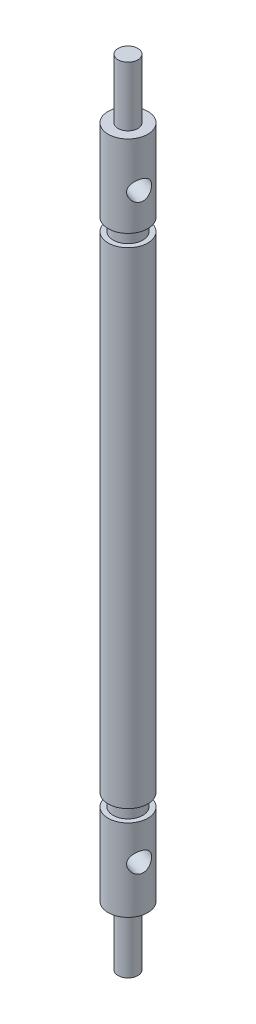
ISO-10303-21;
HEADER;
FILE_DESCRIPTION(('STEP AP214'),'2;1');
FILE_NAME('part.step','',(''),(''),'','','');
FILE_SCHEMA(('AUTOMOTIVE_DESIGN { 1 0 10303 214 1 1 1 1 }'));
ENDSEC;
DATA;
#1=APPLICATION_CONTEXT('core data for automotive mechanical design processes');
#2=APPLICATION_PROTOCOL_DEFINITION('international standard','automotive_design',2000,#1);
#3=PRODUCT_CONTEXT('',#1,'mechanical');
#4=PRODUCT('Part','Part','',(#3));
#5=PRODUCT_RELATED_PRODUCT_CATEGORY('part','',(#4));
#6=PRODUCT_DEFINITION_FORMATION('','',#4);
#7=PRODUCT_DEFINITION_CONTEXT('part definition',#1,'design');
#8=PRODUCT_DEFINITION('design','',#6,#7);
#9=PRODUCT_DEFINITION_SHAPE('','',#8);
#10=(LENGTH_UNIT() NAMED_UNIT(*) SI_UNIT(.MILLI.,.METRE.));
#11=(NAMED_UNIT(*) PLANE_ANGLE_UNIT() SI_UNIT($,.RADIAN.));
#12=(NAMED_UNIT(*) SI_UNIT($,.STERADIAN.) SOLID_ANGLE_UNIT());
#13=UNCERTAINTY_MEASURE_WITH_UNIT(LENGTH_MEASURE(1.E-05),#10,'distance_accuracy_value','');
#14=(GEOMETRIC_REPRESENTATION_CONTEXT(3) GLOBAL_UNCERTAINTY_ASSIGNED_CONTEXT((#13)) GLOBAL_UNIT_ASSIGNED_CONTEXT((#10,
#11,#12)) REPRESENTATION_CONTEXT('',''));
#15=CARTESIAN_POINT('',(0.,0.,0.));
#16=DIRECTION('',(0.,0.,1.));
#17=DIRECTION('',(1.,0.,0.));
#18=AXIS2_PLACEMENT_3D('',#15,#16,#17);
#19=CARTESIAN_POINT('',(0.,20.,1.));
#20=DIRECTION('',(0.,1.,0.));
#21=DIRECTION('',(0.,0.,1.));
#22=AXIS2_PLACEMENT_3D('',#19,#20,#21);
#23=CYLINDRICAL_SURFACE('',#22,2.);
#24=CARTESIAN_POINT('',(0.,4.5,1.));
#25=DIRECTION('',(0.,1.,0.));
#26=DIRECTION('',(0.,0.,1.));
#27=AXIS2_PLACEMENT_3D('',#24,#25,#26);
#28=CIRCLE('',#27,2.);
#29=CARTESIAN_POINT('',(0.,4.5,3.));
#30=VERTEX_POINT('',#29);
#31=EDGE_CURVE('E47',#30,#30,#28,.T.);
#32=ORIENTED_EDGE('',*,*,#31,.F.);
#33=EDGE_LOOP('',(#32));
#34=FACE_BOUND('',#33,.T.);
#35=CARTESIAN_POINT('',(0.,-44.5,0.999999999999996));
#36=DIRECTION('',(0.,1.,0.));
#37=DIRECTION('',(0.,0.,1.));
#38=AXIS2_PLACEMENT_3D('',#35,#36,#37);
#39=CIRCLE('',#38,2.);
#40=CARTESIAN_POINT('',(0.,-44.5,3.));
#41=VERTEX_POINT('',#40);
#42=EDGE_CURVE('E97',#41,#41,#39,.T.);
#43=ORIENTED_EDGE('',*,*,#42,.T.);
#44=EDGE_LOOP('',(#43));
#45=FACE_BOUND('',#44,.T.);
#46=ADVANCED_FACE('F32',(#34,#45),#23,.T.);
#47=CARTESIAN_POINT('',(0.,4.5,-0.499999999999998));
#48=DIRECTION('',(0.,-1.,0.));
#49=DIRECTION('',(0.,0.,-1.));
#50=AXIS2_PLACEMENT_3D('',#47,#48,#49);
#51=PLANE('',#50);
#52=CARTESIAN_POINT('',(0.,4.5,1.));
#53=DIRECTION('',(0.,1.,0.));
#54=DIRECTION('',(0.,0.,1.));
#55=AXIS2_PLACEMENT_3D('',#52,#53,#54);
#56=CIRCLE('',#55,1.5);
#57=CARTESIAN_POINT('',(0.,4.5,2.5));
#58=VERTEX_POINT('',#57);
#59=EDGE_CURVE('E122',#58,#58,#56,.T.);
#60=ORIENTED_EDGE('',*,*,#59,.F.);
#61=EDGE_LOOP('',(#60));
#62=FACE_BOUND('',#61,.T.);
#63=ORIENTED_EDGE('',*,*,#31,.T.);
#64=EDGE_LOOP('',(#63));
#65=FACE_BOUND('',#64,.T.);
#66=ADVANCED_FACE('F85',(#62,#65),#51,.F.);
#67=CARTESIAN_POINT('',(0.,20.,1.));
#68=DIRECTION('',(0.,1.,0.));
#69=DIRECTION('',(0.,0.,1.));
#70=AXIS2_PLACEMENT_3D('',#67,#68,#69);
#71=CYLINDRICAL_SURFACE('',#70,1.5);
#72=CARTESIAN_POINT('',(0.,5.75,1.));
#73=DIRECTION('',(0.,1.,0.));
#74=DIRECTION('',(0.,0.,1.));
#75=AXIS2_PLACEMENT_3D('',#72,#73,#74);
#76=CIRCLE('',#75,1.5);
#77=CARTESIAN_POINT('',(0.,5.75,2.5));
#78=VERTEX_POINT('',#77);
#79=EDGE_CURVE('E119',#78,#78,#76,.T.);
#80=ORIENTED_EDGE('',*,*,#79,.F.);
#81=EDGE_LOOP('',(#80));
#82=FACE_BOUND('',#81,.T.);
#83=ORIENTED_EDGE('',*,*,#59,.T.);
#84=EDGE_LOOP('',(#83));
#85=FACE_BOUND('',#84,.T.);
#86=ADVANCED_FACE('F90',(#82,#85),#71,.T.);
#87=CARTESIAN_POINT('',(0.,5.75,-0.999999999999998));
#88=DIRECTION('',(0.,1.,0.));
#89=DIRECTION('',(0.,0.,1.));
#90=AXIS2_PLACEMENT_3D('',#87,#88,#89);
#91=PLANE('',#90);
#92=CARTESIAN_POINT('',(0.,5.75,1.));
#93=DIRECTION('',(0.,1.,0.));
#94=DIRECTION('',(0.,0.,1.));
#95=AXIS2_PLACEMENT_3D('',#92,#93,#94);
#96=CIRCLE('',#95,2.);
#97=CARTESIAN_POINT('',(0.,5.75,3.));
#98=VERTEX_POINT('',#97);
#99=EDGE_CURVE('E116',#98,#98,#96,.T.);
#100=ORIENTED_EDGE('',*,*,#99,.F.);
#101=EDGE_LOOP('',(#100));
#102=FACE_BOUND('',#101,.T.);
#103=ORIENTED_EDGE('',*,*,#79,.T.);
#104=EDGE_LOOP('',(#103));
#105=FACE_BOUND('',#104,.T.);
#106=ADVANCED_FACE('F153',(#102,#105),#91,.F.);
#107=CARTESIAN_POINT('',(0.,20.,1.));
#108=DIRECTION('',(0.,1.,0.));
#109=DIRECTION('',(0.,0.,1.));
#110=AXIS2_PLACEMENT_3D('',#107,#108,#109);
#111=CYLINDRICAL_SURFACE('',#110,2.);
#112=CARTESIAN_POINT('',(-1.34066947021641,9.34,-0.48411770814503));
#113=CARTESIAN_POINT('',(-1.34067495631126,9.39221773851281,-0.484115624522332));
#114=CARTESIAN_POINT('',(-1.34421081386421,9.44450094997925,-0.480942178894521));
#115=CARTESIAN_POINT('',(-1.3579592981871,9.54746101118554,-0.46834191425801));
#116=CARTESIAN_POINT('',(-1.3681858840927,9.59813426973562,-0.458902020702856));
#117=CARTESIAN_POINT('',(-1.39416948498015,9.69619051353914,-0.434088276347091));
#118=CARTESIAN_POINT('',(-1.40989695468266,9.74358948782048,-0.418746083694171));
#119=CARTESIAN_POINT('',(-1.44554738956168,9.83444453417774,-0.382403252787771));
#120=CARTESIAN_POINT('',(-1.46547059968958,9.8779003758377,-0.361402284149436));
#121=CARTESIAN_POINT('',(-1.50992656043854,9.96361420000878,-0.311988525365269));
#122=CARTESIAN_POINT('',(-1.53470453969664,10.0054741165359,-0.283105567725859));
#123=CARTESIAN_POINT('',(-1.58596273087061,10.0830260022796,-0.219180544457392));
#124=CARTESIAN_POINT('',(-1.61244378645763,10.1187148816874,-0.184135411065621));
#125=CARTESIAN_POINT('',(-1.66736489283058,10.1852813744549,-0.105594797027601));
#126=CARTESIAN_POINT('',(-1.69581598813462,10.2156684548915,-0.0616873751250207));
#127=CARTESIAN_POINT('',(-1.75105325750186,10.2673324658992,0.032132642247083));
#128=CARTESIAN_POINT('',(-1.77784047819767,10.2886151740627,0.0820414034529253));
#129=CARTESIAN_POINT('',(-1.82626343286979,10.3198868706825,0.182893143403869));
#130=CARTESIAN_POINT('',(-1.84813049038064,10.330574153209,0.233507429846059));
#131=CARTESIAN_POINT('',(-1.88784758122288,10.3426520720294,0.337343222890974));
#132=CARTESIAN_POINT('',(-1.90570005270006,10.344048365757,0.390563122999552));
#133=CARTESIAN_POINT('',(-1.93536069636102,10.3377723519725,0.493070055571755));
#134=CARTESIAN_POINT('',(-1.94756072734062,10.3308818468427,0.542294364146645));
#135=CARTESIAN_POINT('',(-1.96795526725166,10.309628005977,0.639943753413213));
#136=CARTESIAN_POINT('',(-1.97614947623568,10.2952641108157,0.688368773993674));
#137=CARTESIAN_POINT('',(-1.98886541828187,10.2593801839495,0.78375113595944));
#138=CARTESIAN_POINT('',(-1.99333498667439,10.2377642648103,0.830679055962354));
#139=CARTESIAN_POINT('',(-1.99896329089706,10.1881235594648,0.921219220578743));
#140=CARTESIAN_POINT('',(-2.0001208413929,10.160096482651,0.964830272688036));
#141=CARTESIAN_POINT('',(-1.99984689182395,10.0953749694863,1.05170908966417));
#142=CARTESIAN_POINT('',(-1.99815933426021,10.0581104942877,1.09455172463637));
#143=CARTESIAN_POINT('',(-1.99281688182107,9.97749650069065,1.17397918749707));
#144=CARTESIAN_POINT('',(-1.98916046838964,9.93414230446298,1.21055915632273));
#145=CARTESIAN_POINT('',(-1.98084631998412,9.8391811107234,1.27836898082197));
#146=CARTESIAN_POINT('',(-1.9761394451166,9.78722335066909,1.30910599564311));
#147=CARTESIAN_POINT('',(-1.96740815472639,9.67850833963811,1.36054489321221));
#148=CARTESIAN_POINT('',(-1.963383027159,9.62175619016679,1.38125728862269));
#149=CARTESIAN_POINT('',(-1.957572056952,9.50979941671064,1.41001521288068));
#150=CARTESIAN_POINT('',(-1.95563384023932,9.45482947527613,1.41893562362223));
#151=CARTESIAN_POINT('',(-1.95403152642566,9.34417238365376,1.42635528222071));
#152=CARTESIAN_POINT('',(-1.95436580426025,9.28848577439312,1.4248619769227));
#153=CARTESIAN_POINT('',(-1.9570404244063,9.18452110507452,1.41233783149607));
#154=CARTESIAN_POINT('',(-1.9591556222701,9.13610292227565,1.40237624149801));
#155=CARTESIAN_POINT('',(-1.96459428602879,9.04152969014304,1.37491820590618));
#156=CARTESIAN_POINT('',(-1.96791814566067,8.99537538386275,1.35741930459393));
#157=CARTESIAN_POINT('',(-1.97520296616847,8.90420808546271,1.31473886781424));
#158=CARTESIAN_POINT('',(-1.97918629491854,8.85934680127512,1.2892392230706));
#159=CARTESIAN_POINT('',(-1.98672573361009,8.77387019246418,1.23185748735409));
#160=CARTESIAN_POINT('',(-1.99028162248134,8.73325706636919,1.19997211624253));
#161=CARTESIAN_POINT('',(-1.99639013921947,8.65204111486908,1.12632084651964));
#162=CARTESIAN_POINT('',(-1.99875835572752,8.61209272080098,1.08381473372484));
#163=CARTESIAN_POINT('',(-2.0005027414476,8.53922501037293,0.99306619968765));
#164=CARTESIAN_POINT('',(-1.99987788555245,8.50630810628365,0.944821818644455));
#165=CARTESIAN_POINT('',(-1.99446779347877,8.44768726585805,0.842565307943967));
#166=CARTESIAN_POINT('',(-1.98957111330545,8.42220113798984,0.788432949866542));
#167=CARTESIAN_POINT('',(-1.97459030366968,8.38076693635274,0.677315911463264));
#168=CARTESIAN_POINT('',(-1.96451076626041,8.36481044625375,0.62033379632291));
#169=CARTESIAN_POINT('',(-1.94001702376064,8.34427022614501,0.510936465631762));
#170=CARTESIAN_POINT('',(-1.92608718972947,8.3387748920953,0.458583648683799));
#171=CARTESIAN_POINT('',(-1.89392673999677,8.33662166463897,0.355038005447414));
#172=CARTESIAN_POINT('',(-1.87569764744383,8.33996064566738,0.30384477536266));
#173=CARTESIAN_POINT('',(-1.83699936104178,8.35477926771913,0.207567698071333));
#174=CARTESIAN_POINT('',(-1.81675944544781,8.36570334513352,0.1623039210795));
#175=CARTESIAN_POINT('',(-1.77402976360227,8.39463039906374,0.0752452691903192));
#176=CARTESIAN_POINT('',(-1.75153967658405,8.41263438591048,0.0334508904211201));
#177=CARTESIAN_POINT('',(-1.70433486705677,8.45600753267434,-0.047634371898612));
#178=CARTESIAN_POINT('',(-1.67956618093429,8.48165793232672,-0.0867425972166629));
#179=CARTESIAN_POINT('',(-1.62989128939637,8.53924318805283,-0.159919650540692));
#180=CARTESIAN_POINT('',(-1.60498502598975,8.5711809280959,-0.193986153326467));
#181=CARTESIAN_POINT('',(-1.5538539302025,8.64413421542679,-0.259939702666818));
#182=CARTESIAN_POINT('',(-1.52774614077153,8.68573804637151,-0.291268538304633));
#183=CARTESIAN_POINT('',(-1.47862187227371,8.77492089879797,-0.347244561152379));
#184=CARTESIAN_POINT('',(-1.45560815968592,8.82250519496273,-0.371885788618689));
#185=CARTESIAN_POINT('',(-1.41390588711489,8.92433664059565,-0.414848892931159));
#186=CARTESIAN_POINT('',(-1.39538143571509,8.97874960036478,-0.432940407552716));
#187=CARTESIAN_POINT('',(-1.36578521112681,9.09142983798596,-0.461184446434746));
#188=CARTESIAN_POINT('',(-1.35468853520988,9.14968351021565,-0.471363517051085));
#189=CARTESIAN_POINT('',(-1.34559685411486,9.2304811406542,-0.479654053608146));
#190=CARTESIAN_POINT('',(-1.34375435515175,9.25230600043196,-0.481326062776323));
#191=CARTESIAN_POINT('',(-1.3412894684682,9.29608337321229,-0.483558365558973));
#192=CARTESIAN_POINT('',(-1.34066716262576,9.31803589468215,-0.484118584569588));
#193=CARTESIAN_POINT('',(-1.34066947021641,9.34,-0.48411770814503));
#194=B_SPLINE_CURVE_WITH_KNOTS('',3,(#112,#113,#114,#115,#116,#117,#118,#119,#120,#121,#122,
#123,#124,#125,#126,#127,#128,#129,#130,#131,#132,#133,#134,#135,#136,#137,#138,#139,#140,#141,
#142,#143,#144,#145,#146,#147,#148,#149,#150,#151,#152,#153,#154,#155,#156,#157,#158,#159,#160,
#161,#162,#163,#164,#165,#166,#167,#168,#169,#170,#171,#172,#173,#174,#175,#176,#177,#178,#179,
#180,#181,#182,#183,#184,#185,#186,#187,#188,#189,#190,#191,#192,#193),.UNSPECIFIED.,.T.,.F.,(4,
2,2,2,2,2,2,2,2,2,2,2,2,2,2,2,2,2,2,2,2,2,2,2,2,2,2,2,2,2,2,2,2,2,2,2,2,2,2,2,4),(0.,
0.156560781054806,0.313449247279704,0.469507686493071,0.625575239076685,0.794582966529236,
0.963675071838096,1.1442364049838,1.32468298415071,1.49223647585247,1.65968793217422,
1.81250654896193,1.96533660672969,2.12027273977692,2.27526431580864,2.44496082287924,
2.61478840279813,2.79549513724577,2.97601195451833,3.14220129757097,3.30827181086935,
3.45604002336207,3.60385641642282,3.75851464903216,3.91325252922087,4.08761323803976,
4.26203366849885,4.44114524425388,4.6200983984601,4.78258010188716,4.94500432726418,
5.09663786318893,5.24829304567236,5.40641280363968,5.56460526000016,5.73860992904884,
5.91276915907046,6.09256560100657,6.27175618823166,6.33760520541497,6.40345864108013),.UNSPECIFIED.);
#195=CARTESIAN_POINT('',(-1.34066947021641,9.34,-0.48411770814503));
#196=VERTEX_POINT('',#195);
#197=EDGE_CURVE('E52',#196,#196,#194,.T.);
#198=ORIENTED_EDGE('',*,*,#197,.T.);
#199=EDGE_LOOP('',(#198));
#200=FACE_BOUND('',#199,.T.);
#201=CARTESIAN_POINT('',(1.95440017994927,9.34,0.57535904976761));
#202=CARTESIAN_POINT('',(1.95440342361498,9.28778226148719,0.5753639403047));
#203=CARTESIAN_POINT('',(1.95542715159816,9.23549905002075,0.580003447477218));
#204=CARTESIAN_POINT('',(1.95925563189273,9.13253898881446,0.598255302964295));
#205=CARTESIAN_POINT('',(1.96206410744266,9.08186573026438,0.611886411308915));
#206=CARTESIAN_POINT('',(1.96871672087867,8.98380948646087,0.64719380654706));
#207=CARTESIAN_POINT('',(1.97255530092737,8.93641051217952,0.668827148449142));
#208=CARTESIAN_POINT('',(1.98034392113383,8.84555546582226,0.719137110292039));
#209=CARTESIAN_POINT('',(1.98429396778744,8.8020996241623,0.74781414146654));
#210=CARTESIAN_POINT('',(1.99162008408547,8.71638579999123,0.813877595987782));
#211=CARTESIAN_POINT('',(1.99492140757062,8.67452588346409,0.851789002732472));
#212=CARTESIAN_POINT('',(1.99931768254791,8.59697399772036,0.933608826300022));
#213=CARTESIAN_POINT('',(2.00041153167618,8.56128511831256,0.977520227707109));
#214=CARTESIAN_POINT('',(1.99926613782536,8.49471862554508,1.07335155897004));
#215=CARTESIAN_POINT('',(1.99679578447245,8.4643315451085,1.12561267143851));
#216=CARTESIAN_POINT('',(1.98700225332396,8.41266753410084,1.2340443934321));
#217=CARTESIAN_POINT('',(1.97968216069102,8.39138482593733,1.29021249720597));
#218=CARTESIAN_POINT('',(1.96025309257445,8.36011312931754,1.40038675600735));
#219=CARTESIAN_POINT('',(1.94852365839426,8.34942584679104,1.4542606325158));
#220=CARTESIAN_POINT('',(1.92028100938038,8.33734792797057,1.56178584815807));
#221=CARTESIAN_POINT('',(1.90377071208484,8.33595163424297,1.61543730283195));
#222=CARTESIAN_POINT('',(1.86813061800388,8.34222764802754,1.71602163909582));
#223=CARTESIAN_POINT('',(1.84935580418471,8.34911815315733,1.76313193177837));
#224=CARTESIAN_POINT('',(1.80901706884323,8.37037199402303,1.85436858512211));
#225=CARTESIAN_POINT('',(1.78745293861569,8.38473588918427,1.898494722123));
#226=CARTESIAN_POINT('',(1.74219578846506,8.42061981605049,1.9834139809312));
#227=CARTESIAN_POINT('',(1.71847752644616,8.44223573518967,2.02415279245311));
#228=CARTESIAN_POINT('',(1.67028302448257,8.49187644053519,2.1010064794022));
#229=CARTESIAN_POINT('',(1.64580651633712,8.51990351734897,2.13711969496431));
#230=CARTESIAN_POINT('',(1.59494969612135,8.58462503051373,2.20755823359963));
#231=CARTESIAN_POINT('',(1.56860908206634,8.62188950571233,2.24138885985895));
#232=CARTESIAN_POINT('',(1.51797632369479,8.70250349930935,2.30281839212349));
#233=CARTESIAN_POINT('',(1.4936857773221,8.74585769553702,2.33041246459175));
#234=CARTESIAN_POINT('',(1.4474091270926,8.8408188892766,2.38066949400917));
#235=CARTESIAN_POINT('',(1.42567032653246,8.89277664933091,2.40290332636754));
#236=CARTESIAN_POINT('',(1.38859591296247,9.00149166036189,2.43961413504078));
#237=CARTESIAN_POINT('',(1.37325359441233,9.05824380983321,2.4540992390128));
#238=CARTESIAN_POINT('',(1.35177104202244,9.17020058328936,2.47408136915927));
#239=CARTESIAN_POINT('',(1.34499709459817,9.22517052472388,2.48020052335871));
#240=CARTESIAN_POINT('',(1.33937076334491,9.33582761634624,2.48529592716056));
#241=CARTESIAN_POINT('',(1.34051271885272,9.39151422560688,2.48427728099926));
#242=CARTESIAN_POINT('',(1.34998537943149,9.49547889492549,2.47565889871762));
#243=CARTESIAN_POINT('',(1.35750995674856,9.54389707772435,2.46879682370405));
#244=CARTESIAN_POINT('',(1.37793237732934,9.63847030985696,2.44965400469367));
#245=CARTESIAN_POINT('',(1.39083197177344,9.68462461613725,2.43737149464213));
#246=CARTESIAN_POINT('',(1.42162642080451,9.7757919145373,2.40693483578462));
#247=CARTESIAN_POINT('',(1.43972485024795,9.82065319872488,2.38853522596093));
#248=CARTESIAN_POINT('',(1.47929432902806,9.90612980753582,2.34630060652743));
#249=CARTESIAN_POINT('',(1.50076711043323,9.94674293363081,2.32246280261615));
#250=CARTESIAN_POINT('',(1.54865592950854,10.0279588851309,2.26617350953028));
#251=CARTESIAN_POINT('',(1.5753535208325,10.067907279199,2.23301304071798));
#252=CARTESIAN_POINT('',(1.629660551494,10.1407749896271,2.16028693995512));
#253=CARTESIAN_POINT('',(1.65727030002357,10.1736918937164,2.12071911801273));
#254=CARTESIAN_POINT('',(1.71247057511626,10.232312734142,2.03447184149587));
#255=CARTESIAN_POINT('',(1.74004061251086,10.2577988620102,1.98762973751021));
#256=CARTESIAN_POINT('',(1.79262771160562,10.2992330636473,1.88860439787607));
#257=CARTESIAN_POINT('',(1.81764700980672,10.3151895537463,1.83642592302506));
#258=CARTESIAN_POINT('',(1.86150157773597,10.335729773855,1.73325375499641));
#259=CARTESIAN_POINT('',(1.88069408323656,10.3412251079047,1.68259306559));
#260=CARTESIAN_POINT('',(1.91490819658876,10.343378335361,1.57970774492777));
#261=CARTESIAN_POINT('',(1.92993127749746,10.3400393543326,1.52748367325747));
#262=CARTESIAN_POINT('',(1.95459648575814,10.3252207322809,1.42669448493019));
#263=CARTESIAN_POINT('',(1.9645297915022,10.3142966548665,1.37811678296918));
#264=CARTESIAN_POINT('',(1.98054643671722,10.2853696009363,1.28246898291377));
#265=CARTESIAN_POINT('',(1.98662922638093,10.2673656140895,1.23539910102846));
#266=CARTESIAN_POINT('',(1.99552798224311,10.2239924673257,1.1419971419908));
#267=CARTESIAN_POINT('',(1.99819364150539,10.1983420676733,1.0957820431544));
#268=CARTESIAN_POINT('',(2.00047617884265,10.1407568119472,1.00736673901651));
#269=CARTESIAN_POINT('',(2.00009165462234,10.1088190719041,0.965168389403552));
#270=CARTESIAN_POINT('',(1.99698091182772,10.0358657845732,0.881774247485424));
#271=CARTESIAN_POINT('',(1.99402446974938,9.9942619536285,0.841100274706379));
#272=CARTESIAN_POINT('',(1.98672944173501,9.90507910120204,0.766983532633031));
#273=CARTESIAN_POINT('',(1.98238963043179,9.85749480503727,0.733547218602144));
#274=CARTESIAN_POINT('',(1.97354164320223,9.75566335940436,0.674330489616679));
#275=CARTESIAN_POINT('',(1.96903256443227,9.70125039963522,0.648832913072782));
#276=CARTESIAN_POINT('',(1.96144353760536,9.58857016201404,0.608632553446653));
#277=CARTESIAN_POINT('',(1.95835882504839,9.53031648978435,0.593893684987414));
#278=CARTESIAN_POINT('',(1.95580271776765,9.4495188593458,0.581857989033015));
#279=CARTESIAN_POINT('',(1.95527996373329,9.42769399956804,0.579425470727412));
#280=CARTESIAN_POINT('',(1.9545780011129,9.38391662678771,0.576174918381155));
#281=CARTESIAN_POINT('',(1.95439881558119,9.36196410531786,0.575356992683661));
#282=CARTESIAN_POINT('',(1.95440017994927,9.34,0.57535904976761));
#283=B_SPLINE_CURVE_WITH_KNOTS('',3,(#201,#202,#203,#204,#205,#206,#207,#208,#209,#210,#211,
#212,#213,#214,#215,#216,#217,#218,#219,#220,#221,#222,#223,#224,#225,#226,#227,#228,#229,#230,
#231,#232,#233,#234,#235,#236,#237,#238,#239,#240,#241,#242,#243,#244,#245,#246,#247,#248,#249,
#250,#251,#252,#253,#254,#255,#256,#257,#258,#259,#260,#261,#262,#263,#264,#265,#266,#267,#268,
#269,#270,#271,#272,#273,#274,#275,#276,#277,#278,#279,#280,#281,#282),.UNSPECIFIED.,.T.,.F.,(4,
2,2,2,2,2,2,2,2,2,2,2,2,2,2,2,2,2,2,2,2,2,2,2,2,2,2,2,2,2,2,2,2,2,2,2,2,2,2,2,4),(0.,
0.156560781054806,0.313449247279704,0.469507686493071,0.625575239076685,0.794582966529236,
0.963675071838096,1.1442364049838,1.32468298415071,1.49223647585247,1.65968793217422,
1.81250654896193,1.96533660672969,2.12027273977692,2.27526431580864,2.44496082287924,
2.61478840279813,2.79549513724578,2.97601195451834,3.14220129757097,3.30827181086936,
3.45604002336208,3.60385641642282,3.75851464903216,3.91325252922087,4.08761323803976,
4.26203366849885,4.44114524425389,4.6200983984601,4.78258010188716,4.94500432726418,
5.09663786318894,5.24829304567236,5.40641280363968,5.56460526000016,5.73860992904884,
5.91276915907046,6.09256560100657,6.27175618823166,6.33760520541497,6.40345864108013),.UNSPECIFIED.);
#284=CARTESIAN_POINT('',(1.95440017994927,9.34,0.57535904976761));
#285=VERTEX_POINT('',#284);
#286=EDGE_CURVE('E43',#285,#285,#283,.T.);
#287=ORIENTED_EDGE('',*,*,#286,.T.);
#288=EDGE_LOOP('',(#287));
#289=FACE_BOUND('',#288,.T.);
#290=CARTESIAN_POINT('',(0.,14.,1.));
#291=DIRECTION('',(0.,1.,0.));
#292=DIRECTION('',(0.,0.,1.));
#293=AXIS2_PLACEMENT_3D('',#290,#291,#292);
#294=CIRCLE('',#293,2.);
#295=CARTESIAN_POINT('',(0.,14.,3.));
#296=VERTEX_POINT('',#295);
#297=EDGE_CURVE('E113',#296,#296,#294,.T.);
#298=ORIENTED_EDGE('',*,*,#297,.F.);
#299=EDGE_LOOP('',(#298));
#300=FACE_BOUND('',#299,.T.);
#301=ORIENTED_EDGE('',*,*,#99,.T.);
#302=EDGE_LOOP('',(#301));
#303=FACE_BOUND('',#302,.T.);
#304=ADVANCED_FACE('F127',(#200,#289,#300,#303),#111,.T.);
#305=CARTESIAN_POINT('',(0.,14.,0.));
#306=DIRECTION('',(0.,-1.,0.));
#307=DIRECTION('',(0.,0.,-1.));
#308=AXIS2_PLACEMENT_3D('',#305,#306,#307);
#309=PLANE('',#308);
#310=CARTESIAN_POINT('',(0.,14.,1.));
#311=DIRECTION('',(0.,1.,0.));
#312=DIRECTION('',(0.,0.,1.));
#313=AXIS2_PLACEMENT_3D('',#310,#311,#312);
#314=CIRCLE('',#313,1.);
#315=CARTESIAN_POINT('',(0.,14.,2.00000000000001));
#316=VERTEX_POINT('',#315);
#317=EDGE_CURVE('E110',#316,#316,#314,.T.);
#318=ORIENTED_EDGE('',*,*,#317,.F.);
#319=EDGE_LOOP('',(#318));
#320=FACE_BOUND('',#319,.T.);
#321=ORIENTED_EDGE('',*,*,#297,.T.);
#322=EDGE_LOOP('',(#321));
#323=FACE_BOUND('',#322,.T.);
#324=ADVANCED_FACE('F146',(#320,#323),#309,.F.);
#325=CARTESIAN_POINT('',(0.,20.,1.));
#326=DIRECTION('',(0.,1.,0.));
#327=DIRECTION('',(0.,0.,1.));
#328=AXIS2_PLACEMENT_3D('',#325,#326,#327);
#329=CYLINDRICAL_SURFACE('',#328,1.);
#330=CARTESIAN_POINT('',(0.,20.,1.));
#331=DIRECTION('',(0.,1.,0.));
#332=DIRECTION('',(0.,0.,1.));
#333=AXIS2_PLACEMENT_3D('',#330,#331,#332);
#334=CIRCLE('',#333,1.);
#335=CARTESIAN_POINT('',(0.,20.,2.00000000000001));
#336=VERTEX_POINT('',#335);
#337=EDGE_CURVE('E102',#336,#336,#334,.T.);
#338=ORIENTED_EDGE('',*,*,#337,.F.);
#339=EDGE_LOOP('',(#338));
#340=FACE_BOUND('',#339,.T.);
#341=ORIENTED_EDGE('',*,*,#317,.T.);
#342=EDGE_LOOP('',(#341));
#343=FACE_BOUND('',#342,.T.);
#344=ADVANCED_FACE('F143',(#340,#343),#329,.T.);
#345=CARTESIAN_POINT('',(0.,20.,1.));
#346=DIRECTION('',(0.,-1.,0.));
#347=DIRECTION('',(0.,0.,-1.));
#348=AXIS2_PLACEMENT_3D('',#345,#346,#347);
#349=PLANE('',#348);
#350=ORIENTED_EDGE('',*,*,#337,.T.);
#351=EDGE_LOOP('',(#350));
#352=FACE_BOUND('',#351,.T.);
#353=ADVANCED_FACE('F137',(#352),#349,.F.);
#354=CARTESIAN_POINT('',(1.90399866172312,9.34,1.61220020920984));
#355=DIRECTION('',(0.95199933086156,0.,0.306100104604919));
#356=DIRECTION('',(0.306100104604919,0.,-0.95199933086156));
#357=AXIS2_PLACEMENT_3D('',#354,#355,#356);
#358=CYLINDRICAL_SURFACE('',#357,1.0025);
#359=ORIENTED_EDGE('',*,*,#286,.F.);
#360=EDGE_LOOP('',(#359));
#361=FACE_BOUND('',#360,.T.);
#362=ORIENTED_EDGE('',*,*,#197,.F.);
#363=EDGE_LOOP('',(#362));
#364=FACE_BOUND('',#363,.T.);
#365=ADVANCED_FACE('F131',(#361,#364),#358,.F.);
#366=CARTESIAN_POINT('',(0.,-44.5,-0.500000000000004));
#367=DIRECTION('',(0.,1.,0.));
#368=DIRECTION('',(0.,0.,-1.));
#369=AXIS2_PLACEMENT_3D('',#366,#367,#368);
#370=PLANE('',#369);
#371=CARTESIAN_POINT('',(0.,-44.5,0.999999999999996));
#372=DIRECTION('',(0.,1.,0.));
#373=DIRECTION('',(0.,0.,1.));
#374=AXIS2_PLACEMENT_3D('',#371,#372,#373);
#375=CIRCLE('',#374,1.5);
#376=CARTESIAN_POINT('',(0.,-44.5,2.5));
#377=VERTEX_POINT('',#376);
#378=EDGE_CURVE('E99',#377,#377,#375,.T.);
#379=ORIENTED_EDGE('',*,*,#378,.T.);
#380=EDGE_LOOP('',(#379));
#381=FACE_BOUND('',#380,.T.);
#382=ORIENTED_EDGE('',*,*,#42,.F.);
#383=EDGE_LOOP('',(#382));
#384=FACE_BOUND('',#383,.T.);
#385=ADVANCED_FACE('F136',(#381,#384),#370,.F.);
#386=CARTESIAN_POINT('',(0.,-60.,0.999999999999994));
#387=DIRECTION('',(0.,-1.,0.));
#388=DIRECTION('',(0.,0.,1.));
#389=AXIS2_PLACEMENT_3D('',#386,#387,#388);
#390=CYLINDRICAL_SURFACE('',#389,1.5);
#391=CARTESIAN_POINT('',(0.,-45.75,0.999999999999996));
#392=DIRECTION('',(0.,1.,0.));
#393=DIRECTION('',(0.,0.,1.));
#394=AXIS2_PLACEMENT_3D('',#391,#392,#393);
#395=CIRCLE('',#394,1.5);
#396=CARTESIAN_POINT('',(0.,-45.75,2.5));
#397=VERTEX_POINT('',#396);
#398=EDGE_CURVE('E104',#397,#397,#395,.T.);
#399=ORIENTED_EDGE('',*,*,#398,.T.);
#400=EDGE_LOOP('',(#399));
#401=FACE_BOUND('',#400,.T.);
#402=ORIENTED_EDGE('',*,*,#378,.F.);
#403=EDGE_LOOP('',(#402));
#404=FACE_BOUND('',#403,.T.);
#405=ADVANCED_FACE('F208',(#401,#404),#390,.T.);
#406=CARTESIAN_POINT('',(0.,-45.75,-1.));
#407=DIRECTION('',(0.,-1.,0.));
#408=DIRECTION('',(0.,0.,1.));
#409=AXIS2_PLACEMENT_3D('',#406,#407,#408);
#410=PLANE('',#409);
#411=CARTESIAN_POINT('',(0.,-45.75,0.999999999999996));
#412=DIRECTION('',(0.,1.,0.));
#413=DIRECTION('',(0.,0.,1.));
#414=AXIS2_PLACEMENT_3D('',#411,#412,#413);
#415=CIRCLE('',#414,2.);
#416=CARTESIAN_POINT('',(0.,-45.75,3.));
#417=VERTEX_POINT('',#416);
#418=EDGE_CURVE('E259',#417,#417,#415,.T.);
#419=ORIENTED_EDGE('',*,*,#418,.T.);
#420=EDGE_LOOP('',(#419));
#421=FACE_BOUND('',#420,.T.);
#422=ORIENTED_EDGE('',*,*,#398,.F.);
#423=EDGE_LOOP('',(#422));
#424=FACE_BOUND('',#423,.T.);
#425=ADVANCED_FACE('F80',(#421,#424),#410,.F.);
#426=CARTESIAN_POINT('',(0.,-60.,0.999999999999994));
#427=DIRECTION('',(0.,-1.,0.));
#428=DIRECTION('',(0.,0.,1.));
#429=AXIS2_PLACEMENT_3D('',#426,#427,#428);
#430=CYLINDRICAL_SURFACE('',#429,2.);
#431=CARTESIAN_POINT('',(-1.34066947021641,-49.34,-0.484117708145036));
#432=CARTESIAN_POINT('',(-1.34067495631126,-49.2877822614872,-0.484115624522338));
#433=CARTESIAN_POINT('',(-1.34421081386421,-49.2354990500208,-0.480942178894527));
#434=CARTESIAN_POINT('',(-1.3579592981871,-49.1325389888145,-0.468341914258016));
#435=CARTESIAN_POINT('',(-1.36818588409271,-49.0818657302644,-0.458902020702862));
#436=CARTESIAN_POINT('',(-1.39416948498015,-48.9838094864609,-0.434088276347097));
#437=CARTESIAN_POINT('',(-1.40989695468267,-48.9364105121795,-0.418746083694177));
#438=CARTESIAN_POINT('',(-1.44554738956168,-48.8455554658223,-0.382403252787778));
#439=CARTESIAN_POINT('',(-1.46547059968958,-48.8020996241623,-0.361402284149444));
#440=CARTESIAN_POINT('',(-1.50992656043854,-48.7163857999912,-0.311988525365278));
#441=CARTESIAN_POINT('',(-1.53470453969664,-48.6745258834641,-0.283105567725868));
#442=CARTESIAN_POINT('',(-1.58596273087061,-48.5969739977204,-0.219180544457402));
#443=CARTESIAN_POINT('',(-1.61244378645763,-48.5612851183126,-0.18413541106563));
#444=CARTESIAN_POINT('',(-1.66736489283058,-48.4947186255451,-0.10559479702761));
#445=CARTESIAN_POINT('',(-1.69581598813462,-48.4643315451085,-0.0616873751250297));
#446=CARTESIAN_POINT('',(-1.75105325750186,-48.4126675341008,0.0321326422470742));
#447=CARTESIAN_POINT('',(-1.77784047819767,-48.3913848259373,0.0820414034529177));
#448=CARTESIAN_POINT('',(-1.82626343286979,-48.3601131293176,0.182893143403862));
#449=CARTESIAN_POINT('',(-1.84813049038064,-48.349425846791,0.233507429846051));
#450=CARTESIAN_POINT('',(-1.88784758122288,-48.3373479279706,0.337343222890965));
#451=CARTESIAN_POINT('',(-1.90570005270006,-48.335951634243,0.390563122999543));
#452=CARTESIAN_POINT('',(-1.93536069636102,-48.3422276480275,0.493070055571744));
#453=CARTESIAN_POINT('',(-1.94756072734062,-48.3491181531573,0.542294364146634));
#454=CARTESIAN_POINT('',(-1.96795526725166,-48.370371994023,0.639943753413202));
#455=CARTESIAN_POINT('',(-1.97614947623568,-48.3847358891843,0.688368773993663));
#456=CARTESIAN_POINT('',(-1.98886541828187,-48.4206198160505,0.78375113595943));
#457=CARTESIAN_POINT('',(-1.99333498667439,-48.4422357351897,0.830679055962345));
#458=CARTESIAN_POINT('',(-1.99896329089706,-48.4918764405352,0.921219220578734));
#459=CARTESIAN_POINT('',(-2.0001208413929,-48.519903517349,0.964830272688026));
#460=CARTESIAN_POINT('',(-1.99984689182395,-48.5846250305137,1.05170908966415));
#461=CARTESIAN_POINT('',(-1.99815933426021,-48.6218895057123,1.09455172463636));
#462=CARTESIAN_POINT('',(-1.99281688182107,-48.7025034993094,1.17397918749706));
#463=CARTESIAN_POINT('',(-1.98916046838964,-48.745857695537,1.21055915632272));
#464=CARTESIAN_POINT('',(-1.98084631998412,-48.8408188892766,1.27836898082196));
#465=CARTESIAN_POINT('',(-1.9761394451166,-48.8927766493309,1.3091059956431));
#466=CARTESIAN_POINT('',(-1.96740815472639,-49.0014916603619,1.3605448932122));
#467=CARTESIAN_POINT('',(-1.963383027159,-49.0582438098332,1.38125728862268));
#468=CARTESIAN_POINT('',(-1.957572056952,-49.1702005832894,1.41001521288067));
#469=CARTESIAN_POINT('',(-1.95563384023932,-49.2251705247239,1.41893562362222));
#470=CARTESIAN_POINT('',(-1.95403152642566,-49.3358276163462,1.4263552822207));
#471=CARTESIAN_POINT('',(-1.95436580426025,-49.3915142256069,1.42486197692269));
#472=CARTESIAN_POINT('',(-1.9570404244063,-49.4954788949255,1.41233783149606));
#473=CARTESIAN_POINT('',(-1.9591556222701,-49.5438970777244,1.402376241498));
#474=CARTESIAN_POINT('',(-1.96459428602879,-49.638470309857,1.37491820590617));
#475=CARTESIAN_POINT('',(-1.96791814566067,-49.6846246161372,1.35741930459392));
#476=CARTESIAN_POINT('',(-1.97520296616847,-49.7757919145373,1.31473886781423));
#477=CARTESIAN_POINT('',(-1.97918629491854,-49.8206531987249,1.28923922307059));
#478=CARTESIAN_POINT('',(-1.98672573361009,-49.9061298075358,1.23185748735408));
#479=CARTESIAN_POINT('',(-1.99028162248134,-49.9467429336308,1.19997211624252));
#480=CARTESIAN_POINT('',(-1.99639013921947,-50.0279588851309,1.12632084651963));
#481=CARTESIAN_POINT('',(-1.99875835572752,-50.067907279199,1.08381473372483));
#482=CARTESIAN_POINT('',(-2.0005027414476,-50.1407749896271,0.993066199687642));
#483=CARTESIAN_POINT('',(-1.99987788555245,-50.1736918937164,0.944821818644448));
#484=CARTESIAN_POINT('',(-1.99446779347877,-50.2323127341419,0.84256530794396));
#485=CARTESIAN_POINT('',(-1.98957111330545,-50.2577988620102,0.788432949866535));
#486=CARTESIAN_POINT('',(-1.97459030366968,-50.2992330636473,0.677315911463256));
#487=CARTESIAN_POINT('',(-1.96451076626041,-50.3151895537463,0.620333796322902));
#488=CARTESIAN_POINT('',(-1.94001702376064,-50.335729773855,0.510936465631753));
#489=CARTESIAN_POINT('',(-1.92608718972947,-50.3412251079047,0.45858364868379));
#490=CARTESIAN_POINT('',(-1.89392673999677,-50.343378335361,0.355038005447407));
#491=CARTESIAN_POINT('',(-1.87569764744383,-50.3400393543326,0.303844775362653));
#492=CARTESIAN_POINT('',(-1.83699936104178,-50.3252207322809,0.207567698071326));
#493=CARTESIAN_POINT('',(-1.81675944544781,-50.3142966548665,0.162303921079493));
#494=CARTESIAN_POINT('',(-1.77402976360227,-50.2853696009363,0.0752452691903127));
#495=CARTESIAN_POINT('',(-1.75153967658405,-50.2673656140895,0.0334508904211141));
#496=CARTESIAN_POINT('',(-1.70433486705677,-50.2239924673257,-0.0476343718986204));
#497=CARTESIAN_POINT('',(-1.67956618093428,-50.1983420676733,-0.0867425972166738));
#498=CARTESIAN_POINT('',(-1.62989128939637,-50.1407568119472,-0.159919650540702));
#499=CARTESIAN_POINT('',(-1.60498502598975,-50.1088190719041,-0.193986153326474));
#500=CARTESIAN_POINT('',(-1.5538539302025,-50.0358657845732,-0.259939702666821));
#501=CARTESIAN_POINT('',(-1.52774614077153,-49.9942619536285,-0.291268538304637));
#502=CARTESIAN_POINT('',(-1.47862187227371,-49.905079101202,-0.347244561152384));
#503=CARTESIAN_POINT('',(-1.45560815968592,-49.8574948050373,-0.371885788618693));
#504=CARTESIAN_POINT('',(-1.4139058871149,-49.7556633594044,-0.414848892931163));
#505=CARTESIAN_POINT('',(-1.39538143571509,-49.7012503996352,-0.432940407552721));
#506=CARTESIAN_POINT('',(-1.36578521112681,-49.588570162014,-0.461184446434752));
#507=CARTESIAN_POINT('',(-1.35468853520988,-49.5303164897844,-0.47136351705109));
#508=CARTESIAN_POINT('',(-1.34559685411486,-49.4495188593458,-0.479654053608151));
#509=CARTESIAN_POINT('',(-1.34375435515175,-49.427693999568,-0.481326062776329));
#510=CARTESIAN_POINT('',(-1.3412894684682,-49.3839166267877,-0.483558365558979));
#511=CARTESIAN_POINT('',(-1.34066716262576,-49.3619641053179,-0.484118584569593));
#512=CARTESIAN_POINT('',(-1.34066947021641,-49.34,-0.484117708145036));
#513=B_SPLINE_CURVE_WITH_KNOTS('',3,(#431,#432,#433,#434,#435,#436,#437,#438,#439,#440,#441,
#442,#443,#444,#445,#446,#447,#448,#449,#450,#451,#452,#453,#454,#455,#456,#457,#458,#459,#460,
#461,#462,#463,#464,#465,#466,#467,#468,#469,#470,#471,#472,#473,#474,#475,#476,#477,#478,#479,
#480,#481,#482,#483,#484,#485,#486,#487,#488,#489,#490,#491,#492,#493,#494,#495,#496,#497,#498,
#499,#500,#501,#502,#503,#504,#505,#506,#507,#508,#509,#510,#511,#512),.UNSPECIFIED.,.T.,.F.,(4,
2,2,2,2,2,2,2,2,2,2,2,2,2,2,2,2,2,2,2,2,2,2,2,2,2,2,2,2,2,2,2,2,2,2,2,2,2,2,2,4),(0.,
0.156560781054806,0.313449247279702,0.469507686493065,0.625575239076675,0.794582966529226,
0.963675071838092,1.14423640498379,1.32468298415071,1.49223647585246,1.65968793217421,
1.81250654896193,1.96533660672968,2.12027273977691,2.27526431580863,2.44496082287923,
2.61478840279812,2.79549513724576,2.97601195451833,3.14220129757096,3.30827181086935,
3.45604002336207,3.60385641642281,3.75851464903214,3.91325252922086,4.08761323803974,
4.26203366849884,4.44114524425387,4.62009839846008,4.78258010188715,4.94500432726417,
5.09663786318892,5.24829304567235,5.40641280363967,5.56460526000014,5.73860992904882,
5.91276915907044,6.09256560100655,6.27175618823164,6.33760520541496,6.40345864108011),.UNSPECIFIED.);
#514=CARTESIAN_POINT('',(-1.34066947021641,-49.34,-0.484117708145036));
#515=VERTEX_POINT('',#514);
#516=EDGE_CURVE('E35',#515,#515,#513,.T.);
#517=ORIENTED_EDGE('',*,*,#516,.T.);
#518=EDGE_LOOP('',(#517));
#519=FACE_BOUND('',#518,.T.);
#520=CARTESIAN_POINT('',(1.95440017994927,-49.34,0.575359049767605));
#521=CARTESIAN_POINT('',(1.95440342361498,-49.3922177385128,0.575363940304696));
#522=CARTESIAN_POINT('',(1.95542715159816,-49.4445009499793,0.580003447477213));
#523=CARTESIAN_POINT('',(1.95925563189273,-49.5474610111855,0.598255302964289));
#524=CARTESIAN_POINT('',(1.96206410744266,-49.5981342697356,0.61188641130891));
#525=CARTESIAN_POINT('',(1.96871672087867,-49.6961905135391,0.647193806547054));
#526=CARTESIAN_POINT('',(1.97255530092737,-49.7435894878205,0.668827148449137));
#527=CARTESIAN_POINT('',(1.98034392113383,-49.8344445341777,0.719137110292032));
#528=CARTESIAN_POINT('',(1.98429396778744,-49.8779003758377,0.747814141466532));
#529=CARTESIAN_POINT('',(1.99162008408547,-49.9636142000088,0.813877595987772));
#530=CARTESIAN_POINT('',(1.99492140757062,-50.0054741165359,0.851789002732462));
#531=CARTESIAN_POINT('',(1.99931768254791,-50.0830260022796,0.933608826300011));
#532=CARTESIAN_POINT('',(2.00041153167618,-50.1187148816874,0.977520227707101));
#533=CARTESIAN_POINT('',(1.99926613782536,-50.1852813744549,1.07335155897003));
#534=CARTESIAN_POINT('',(1.99679578447245,-50.2156684548915,1.1256126714385));
#535=CARTESIAN_POINT('',(1.98700225332396,-50.2673324658992,1.23404439343209));
#536=CARTESIAN_POINT('',(1.97968216069102,-50.2886151740627,1.29021249720596));
#537=CARTESIAN_POINT('',(1.96025309257445,-50.3198868706825,1.40038675600734));
#538=CARTESIAN_POINT('',(1.94852365839426,-50.330574153209,1.45426063251579));
#539=CARTESIAN_POINT('',(1.92028100938038,-50.3426520720294,1.56178584815806));
#540=CARTESIAN_POINT('',(1.90377071208484,-50.344048365757,1.61543730283194));
#541=CARTESIAN_POINT('',(1.86813061800388,-50.3377723519725,1.71602163909581));
#542=CARTESIAN_POINT('',(1.84935580418471,-50.3308818468427,1.76313193177835));
#543=CARTESIAN_POINT('',(1.80901706884323,-50.309628005977,1.8543685851221));
#544=CARTESIAN_POINT('',(1.78745293861569,-50.2952641108157,1.89849472212299));
#545=CARTESIAN_POINT('',(1.74219578846506,-50.2593801839495,1.98341398093119));
#546=CARTESIAN_POINT('',(1.71847752644616,-50.2377642648103,2.0241527924531));
#547=CARTESIAN_POINT('',(1.67028302448257,-50.1881235594648,2.10100647940218));
#548=CARTESIAN_POINT('',(1.64580651633712,-50.160096482651,2.1371196949643));
#549=CARTESIAN_POINT('',(1.59494969612135,-50.0953749694863,2.20755823359962));
#550=CARTESIAN_POINT('',(1.56860908206635,-50.0581104942877,2.24138885985893));
#551=CARTESIAN_POINT('',(1.5179763236948,-49.9774965006906,2.30281839212348));
#552=CARTESIAN_POINT('',(1.49368577732211,-49.934142304463,2.33041246459174));
#553=CARTESIAN_POINT('',(1.4474091270926,-49.8391811107234,2.38066949400916));
#554=CARTESIAN_POINT('',(1.42567032653246,-49.7872233506691,2.40290332636753));
#555=CARTESIAN_POINT('',(1.38859591296248,-49.6785083396381,2.43961413504077));
#556=CARTESIAN_POINT('',(1.37325359441233,-49.6217561901668,2.45409923901279));
#557=CARTESIAN_POINT('',(1.35177104202244,-49.5097994167106,2.47408136915926));
#558=CARTESIAN_POINT('',(1.34499709459817,-49.4548294752761,2.4802005233587));
#559=CARTESIAN_POINT('',(1.33937076334491,-49.3441723836538,2.48529592716056));
#560=CARTESIAN_POINT('',(1.34051271885273,-49.2884857743931,2.48427728099925));
#561=CARTESIAN_POINT('',(1.34998537943149,-49.1845211050745,2.47565889871761));
#562=CARTESIAN_POINT('',(1.35750995674857,-49.1361029222757,2.46879682370404));
#563=CARTESIAN_POINT('',(1.37793237732934,-49.041529690143,2.44965400469366));
#564=CARTESIAN_POINT('',(1.39083197177344,-48.9953753838628,2.43737149464212));
#565=CARTESIAN_POINT('',(1.42162642080451,-48.9042080854627,2.40693483578461));
#566=CARTESIAN_POINT('',(1.43972485024796,-48.8593468012751,2.38853522596092));
#567=CARTESIAN_POINT('',(1.47929432902807,-48.7738701924642,2.34630060652742));
#568=CARTESIAN_POINT('',(1.50076711043323,-48.7332570663692,2.32246280261614));
#569=CARTESIAN_POINT('',(1.54865592950854,-48.6520411148691,2.26617350953028));
#570=CARTESIAN_POINT('',(1.5753535208325,-48.612092720801,2.23301304071797));
#571=CARTESIAN_POINT('',(1.629660551494,-48.5392250103729,2.16028693995511));
#572=CARTESIAN_POINT('',(1.65727030002357,-48.5063081062837,2.12071911801272));
#573=CARTESIAN_POINT('',(1.71247057511626,-48.4476872658581,2.03447184149586));
#574=CARTESIAN_POINT('',(1.74004061251086,-48.4222011379898,1.9876297375102));
#575=CARTESIAN_POINT('',(1.79262771160562,-48.3807669363527,1.88860439787606));
#576=CARTESIAN_POINT('',(1.81764700980673,-48.3648104462537,1.83642592302505));
#577=CARTESIAN_POINT('',(1.86150157773597,-48.344270226145,1.7332537549964));
#578=CARTESIAN_POINT('',(1.88069408323656,-48.3387748920953,1.68259306558999));
#579=CARTESIAN_POINT('',(1.91490819658876,-48.336621664639,1.57970774492777));
#580=CARTESIAN_POINT('',(1.92993127749746,-48.3399606456674,1.52748367325747));
#581=CARTESIAN_POINT('',(1.95459648575814,-48.3547792677191,1.42669448493018));
#582=CARTESIAN_POINT('',(1.9645297915022,-48.3657033451335,1.37811678296918));
#583=CARTESIAN_POINT('',(1.98054643671722,-48.3946303990637,1.28246898291377));
#584=CARTESIAN_POINT('',(1.98662922638093,-48.4126343859105,1.23539910102845));
#585=CARTESIAN_POINT('',(1.99552798224311,-48.4560075326743,1.1419971419908));
#586=CARTESIAN_POINT('',(1.99819364150539,-48.4816579323267,1.09578204315439));
#587=CARTESIAN_POINT('',(2.00047617884265,-48.5392431880528,1.0073667390165));
#588=CARTESIAN_POINT('',(2.00009165462234,-48.5711809280959,0.965168389403548));
#589=CARTESIAN_POINT('',(1.99698091182772,-48.6441342154268,0.881774247485421));
#590=CARTESIAN_POINT('',(1.99402446974938,-48.6857380463715,0.841100274706376));
#591=CARTESIAN_POINT('',(1.98672944173501,-48.774920898798,0.766983532633027));
#592=CARTESIAN_POINT('',(1.9823896304318,-48.8225051949627,0.733547218602139));
#593=CARTESIAN_POINT('',(1.97354164320223,-48.9243366405956,0.674330489616674));
#594=CARTESIAN_POINT('',(1.96903256443227,-48.9787496003648,0.648832913072776));
#595=CARTESIAN_POINT('',(1.96144353760536,-49.091429837986,0.608632553446647));
#596=CARTESIAN_POINT('',(1.95835882504839,-49.1496835102157,0.593893684987409));
#597=CARTESIAN_POINT('',(1.95580271776765,-49.2304811406542,0.58185798903301));
#598=CARTESIAN_POINT('',(1.95527996373329,-49.252306000432,0.579425470727407));
#599=CARTESIAN_POINT('',(1.9545780011129,-49.2960833732123,0.57617491838115));
#600=CARTESIAN_POINT('',(1.95439881558119,-49.3180358946821,0.575356992683657));
#601=CARTESIAN_POINT('',(1.95440017994927,-49.34,0.575359049767605));
#602=B_SPLINE_CURVE_WITH_KNOTS('',3,(#520,#521,#522,#523,#524,#525,#526,#527,#528,#529,#530,
#531,#532,#533,#534,#535,#536,#537,#538,#539,#540,#541,#542,#543,#544,#545,#546,#547,#548,#549,
#550,#551,#552,#553,#554,#555,#556,#557,#558,#559,#560,#561,#562,#563,#564,#565,#566,#567,#568,
#569,#570,#571,#572,#573,#574,#575,#576,#577,#578,#579,#580,#581,#582,#583,#584,#585,#586,#587,
#588,#589,#590,#591,#592,#593,#594,#595,#596,#597,#598,#599,#600,#601),.UNSPECIFIED.,.T.,.F.,(4,
2,2,2,2,2,2,2,2,2,2,2,2,2,2,2,2,2,2,2,2,2,2,2,2,2,2,2,2,2,2,2,2,2,2,2,2,2,2,2,4),(0.,
0.156560781054806,0.313449247279703,0.469507686493066,0.625575239076675,0.794582966529226,
0.963675071838093,1.14423640498379,1.32468298415071,1.49223647585246,1.65968793217421,
1.81250654896193,1.96533660672968,2.12027273977691,2.27526431580863,2.44496082287923,
2.61478840279812,2.79549513724576,2.97601195451833,3.14220129757097,3.30827181086934,
3.45604002336206,3.60385641642281,3.75851464903215,3.91325252922086,4.08761323803974,
4.26203366849884,4.44114524425387,4.62009839846008,4.78258010188714,4.94500432726417,
5.09663786318892,5.24829304567235,5.40641280363966,5.56460526000014,5.73860992904881,
5.91276915907044,6.09256560100655,6.27175618823163,6.33760520541495,6.40345864108011),.UNSPECIFIED.);
#603=CARTESIAN_POINT('',(1.95440017994927,-49.34,0.575359049767605));
#604=VERTEX_POINT('',#603);
#605=EDGE_CURVE('E10',#604,#604,#602,.T.);
#606=ORIENTED_EDGE('',*,*,#605,.T.);
#607=EDGE_LOOP('',(#606));
#608=FACE_BOUND('',#607,.T.);
#609=CARTESIAN_POINT('',(0.,-54.,0.999999999999995));
#610=DIRECTION('',(0.,1.,0.));
#611=DIRECTION('',(0.,0.,1.));
#612=AXIS2_PLACEMENT_3D('',#609,#610,#611);
#613=CIRCLE('',#612,2.);
#614=CARTESIAN_POINT('',(0.,-54.,2.99999999999999));
#615=VERTEX_POINT('',#614);
#616=EDGE_CURVE('E262',#615,#615,#613,.T.);
#617=ORIENTED_EDGE('',*,*,#616,.T.);
#618=EDGE_LOOP('',(#617));
#619=FACE_BOUND('',#618,.T.);
#620=ORIENTED_EDGE('',*,*,#418,.F.);
#621=EDGE_LOOP('',(#620));
#622=FACE_BOUND('',#621,.T.);
#623=ADVANCED_FACE('F57',(#519,#608,#619,#622),#430,.T.);
#624=CARTESIAN_POINT('',(0.,-54.,0.));
#625=DIRECTION('',(0.,1.,0.));
#626=DIRECTION('',(0.,0.,-1.));
#627=AXIS2_PLACEMENT_3D('',#624,#625,#626);
#628=PLANE('',#627);
#629=CARTESIAN_POINT('',(0.,-54.,0.999999999999995));
#630=DIRECTION('',(0.,1.,0.));
#631=DIRECTION('',(0.,0.,1.));
#632=AXIS2_PLACEMENT_3D('',#629,#630,#631);
#633=CIRCLE('',#632,1.);
#634=CARTESIAN_POINT('',(0.,-54.,2.));
#635=VERTEX_POINT('',#634);
#636=EDGE_CURVE('E267',#635,#635,#633,.T.);
#637=ORIENTED_EDGE('',*,*,#636,.T.);
#638=EDGE_LOOP('',(#637));
#639=FACE_BOUND('',#638,.T.);
#640=ORIENTED_EDGE('',*,*,#616,.F.);
#641=EDGE_LOOP('',(#640));
#642=FACE_BOUND('',#641,.T.);
#643=ADVANCED_FACE('F73',(#639,#642),#628,.F.);
#644=CARTESIAN_POINT('',(0.,-60.,0.999999999999994));
#645=DIRECTION('',(0.,-1.,0.));
#646=DIRECTION('',(0.,0.,1.));
#647=AXIS2_PLACEMENT_3D('',#644,#645,#646);
#648=CYLINDRICAL_SURFACE('',#647,1.);
#649=CARTESIAN_POINT('',(0.,-60.,0.999999999999994));
#650=DIRECTION('',(0.,1.,0.));
#651=DIRECTION('',(0.,0.,1.));
#652=AXIS2_PLACEMENT_3D('',#649,#650,#651);
#653=CIRCLE('',#652,1.);
#654=CARTESIAN_POINT('',(0.,-60.,1.99999999999999));
#655=VERTEX_POINT('',#654);
#656=EDGE_CURVE('E269',#655,#655,#653,.T.);
#657=ORIENTED_EDGE('',*,*,#656,.T.);
#658=EDGE_LOOP('',(#657));
#659=FACE_BOUND('',#658,.T.);
#660=ORIENTED_EDGE('',*,*,#636,.F.);
#661=EDGE_LOOP('',(#660));
#662=FACE_BOUND('',#661,.T.);
#663=ADVANCED_FACE('F70',(#659,#662),#648,.T.);
#664=CARTESIAN_POINT('',(0.,-60.,0.999999999999994));
#665=DIRECTION('',(0.,1.,0.));
#666=DIRECTION('',(0.,0.,-1.));
#667=AXIS2_PLACEMENT_3D('',#664,#665,#666);
#668=PLANE('',#667);
#669=ORIENTED_EDGE('',*,*,#656,.F.);
#670=EDGE_LOOP('',(#669));
#671=FACE_BOUND('',#670,.T.);
#672=ADVANCED_FACE('F65',(#671),#668,.F.);
#673=CARTESIAN_POINT('',(1.90399866172312,-49.34,1.61220020920983));
#674=DIRECTION('',(0.95199933086156,0.,0.306100104604919));
#675=DIRECTION('',(0.306100104604919,0.,-0.95199933086156));
#676=AXIS2_PLACEMENT_3D('',#673,#674,#675);
#677=CYLINDRICAL_SURFACE('',#676,1.0025);
#678=ORIENTED_EDGE('',*,*,#605,.F.);
#679=EDGE_LOOP('',(#678));
#680=FACE_BOUND('',#679,.T.);
#681=ORIENTED_EDGE('',*,*,#516,.F.);
#682=EDGE_LOOP('',(#681));
#683=FACE_BOUND('',#682,.T.);
#684=ADVANCED_FACE('F61',(#680,#683),#677,.F.);
#685=CLOSED_SHELL('',(#46,#66,#86,#106,#304,#324,#344,#353,#365,#385,#405,#425,#623,#643,#663,
#672,#684));
#686=MANIFOLD_SOLID_BREP('B2',#685);
#687=ADVANCED_BREP_SHAPE_REPRESENTATION('',(#18,#686),#14);
#688=SHAPE_DEFINITION_REPRESENTATION(#9,#687);
ENDSEC;
END-ISO-10303-21;
